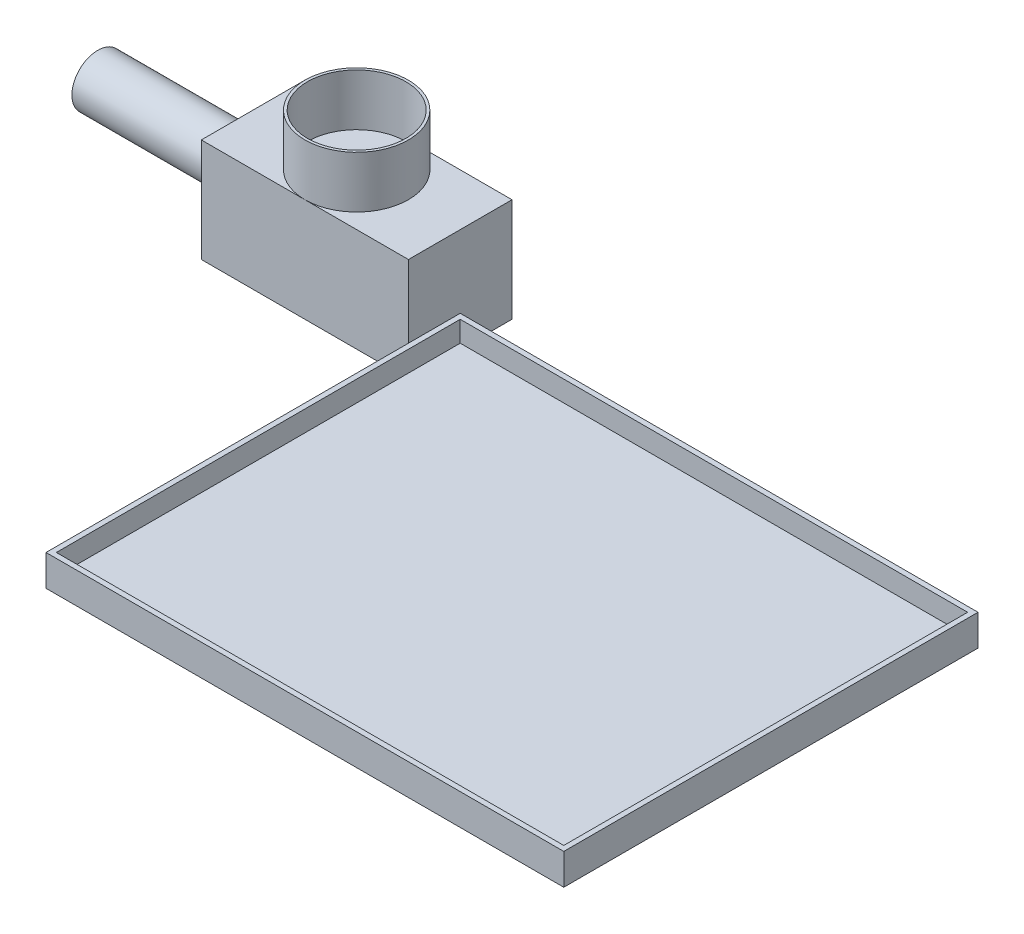
ISO-10303-21;
HEADER;
FILE_DESCRIPTION(('STEP AP214'),'2;1');
FILE_NAME('part.step','',(''),(''),'','','');
FILE_SCHEMA(('AUTOMOTIVE_DESIGN { 1 0 10303 214 1 1 1 1 }'));
ENDSEC;
DATA;
#1=APPLICATION_CONTEXT('core data for automotive mechanical design processes');
#2=APPLICATION_PROTOCOL_DEFINITION('international standard','automotive_design',2000,#1);
#3=PRODUCT_CONTEXT('',#1,'mechanical');
#4=PRODUCT('Part','Part','',(#3));
#5=PRODUCT_RELATED_PRODUCT_CATEGORY('part','',(#4));
#6=PRODUCT_DEFINITION_FORMATION('','',#4);
#7=PRODUCT_DEFINITION_CONTEXT('part definition',#1,'design');
#8=PRODUCT_DEFINITION('design','',#6,#7);
#9=PRODUCT_DEFINITION_SHAPE('','',#8);
#10=(LENGTH_UNIT() NAMED_UNIT(*) SI_UNIT(.MILLI.,.METRE.));
#11=(NAMED_UNIT(*) PLANE_ANGLE_UNIT() SI_UNIT($,.RADIAN.));
#12=(NAMED_UNIT(*) SI_UNIT($,.STERADIAN.) SOLID_ANGLE_UNIT());
#13=UNCERTAINTY_MEASURE_WITH_UNIT(LENGTH_MEASURE(1.E-05),#10,'distance_accuracy_value','');
#14=(GEOMETRIC_REPRESENTATION_CONTEXT(3) GLOBAL_UNCERTAINTY_ASSIGNED_CONTEXT((#13)) GLOBAL_UNIT_ASSIGNED_CONTEXT((#10,
#11,#12)) REPRESENTATION_CONTEXT('',''));
#15=CARTESIAN_POINT('',(0.,0.,0.));
#16=DIRECTION('',(0.,0.,1.));
#17=DIRECTION('',(1.,0.,0.));
#18=AXIS2_PLACEMENT_3D('',#15,#16,#17);
#19=CARTESIAN_POINT('',(845.,-20.,395.));
#20=DIRECTION('',(-1.,0.,0.));
#21=DIRECTION('',(0.,0.,1.));
#22=AXIS2_PLACEMENT_3D('',#19,#20,#21);
#23=PLANE('',#22);
#24=DIRECTION('',(0.,-1.,0.));
#25=VECTOR('',#24,1.);
#26=CARTESIAN_POINT('',(845.,-20.,5.));
#27=LINE('',#26,#25);
#28=CARTESIAN_POINT('',(845.,-20.,5.));
#29=VERTEX_POINT('',#28);
#30=CARTESIAN_POINT('',(845.,-40.,5.));
#31=VERTEX_POINT('',#30);
#32=EDGE_CURVE('E161',#29,#31,#27,.T.);
#33=ORIENTED_EDGE('',*,*,#32,.T.);
#34=DIRECTION('',(0.,0.,1.));
#35=VECTOR('',#34,1.);
#36=CARTESIAN_POINT('',(845.,-40.,395.));
#37=LINE('',#36,#35);
#38=CARTESIAN_POINT('',(845.,-40.,395.));
#39=VERTEX_POINT('',#38);
#40=EDGE_CURVE('E143',#31,#39,#37,.T.);
#41=ORIENTED_EDGE('',*,*,#40,.T.);
#42=DIRECTION('',(0.,-1.,0.));
#43=VECTOR('',#42,1.);
#44=CARTESIAN_POINT('',(845.,-20.,395.));
#45=LINE('',#44,#43);
#46=CARTESIAN_POINT('',(845.,-20.,395.));
#47=VERTEX_POINT('',#46);
#48=EDGE_CURVE('E165',#47,#39,#45,.T.);
#49=ORIENTED_EDGE('',*,*,#48,.F.);
#50=DIRECTION('',(0.,0.,-1.));
#51=VECTOR('',#50,1.);
#52=CARTESIAN_POINT('',(845.,-20.,395.));
#53=LINE('',#52,#51);
#54=EDGE_CURVE('E430',#47,#29,#53,.T.);
#55=ORIENTED_EDGE('',*,*,#54,.T.);
#56=EDGE_LOOP('',(#33,#41,#49,#55));
#57=FACE_BOUND('',#56,.T.);
#58=ADVANCED_FACE('F39',(#57),#23,.T.);
#59=CARTESIAN_POINT('',(355.,-20.,5.));
#60=DIRECTION('',(0.,0.,1.));
#61=DIRECTION('',(1.,0.,0.));
#62=AXIS2_PLACEMENT_3D('',#59,#60,#61);
#63=PLANE('',#62);
#64=DIRECTION('',(0.,-1.,0.));
#65=VECTOR('',#64,1.);
#66=CARTESIAN_POINT('',(355.,-20.,5.));
#67=LINE('',#66,#65);
#68=CARTESIAN_POINT('',(355.,-20.,5.));
#69=VERTEX_POINT('',#68);
#70=CARTESIAN_POINT('',(355.,-40.,5.));
#71=VERTEX_POINT('',#70);
#72=EDGE_CURVE('E154',#69,#71,#67,.T.);
#73=ORIENTED_EDGE('',*,*,#72,.T.);
#74=DIRECTION('',(1.,0.,0.));
#75=VECTOR('',#74,1.);
#76=CARTESIAN_POINT('',(355.,-40.,5.));
#77=LINE('',#76,#75);
#78=EDGE_CURVE('E140',#71,#31,#77,.T.);
#79=ORIENTED_EDGE('',*,*,#78,.T.);
#80=ORIENTED_EDGE('',*,*,#32,.F.);
#81=DIRECTION('',(-1.,0.,0.));
#82=VECTOR('',#81,1.);
#83=CARTESIAN_POINT('',(355.,-20.,5.));
#84=LINE('',#83,#82);
#85=EDGE_CURVE('E160',#29,#69,#84,.T.);
#86=ORIENTED_EDGE('',*,*,#85,.T.);
#87=EDGE_LOOP('',(#73,#79,#80,#86));
#88=FACE_BOUND('',#87,.T.);
#89=ADVANCED_FACE('F158',(#88),#63,.T.);
#90=CARTESIAN_POINT('',(355.,-20.,395.));
#91=DIRECTION('',(1.,0.,0.));
#92=DIRECTION('',(0.,0.,-1.));
#93=AXIS2_PLACEMENT_3D('',#90,#91,#92);
#94=PLANE('',#93);
#95=DIRECTION('',(0.,-1.,0.));
#96=VECTOR('',#95,1.);
#97=CARTESIAN_POINT('',(355.,-20.,395.));
#98=LINE('',#97,#96);
#99=CARTESIAN_POINT('',(355.,-20.,395.));
#100=VERTEX_POINT('',#99);
#101=CARTESIAN_POINT('',(355.,-40.,395.));
#102=VERTEX_POINT('',#101);
#103=EDGE_CURVE('E156',#100,#102,#98,.T.);
#104=ORIENTED_EDGE('',*,*,#103,.T.);
#105=DIRECTION('',(0.,0.,-1.));
#106=VECTOR('',#105,1.);
#107=CARTESIAN_POINT('',(355.,-40.,395.));
#108=LINE('',#107,#106);
#109=EDGE_CURVE('E57',#102,#71,#108,.T.);
#110=ORIENTED_EDGE('',*,*,#109,.T.);
#111=ORIENTED_EDGE('',*,*,#72,.F.);
#112=DIRECTION('',(0.,0.,1.));
#113=VECTOR('',#112,1.);
#114=CARTESIAN_POINT('',(355.,-20.,395.));
#115=LINE('',#114,#113);
#116=EDGE_CURVE('E425',#69,#100,#115,.T.);
#117=ORIENTED_EDGE('',*,*,#116,.T.);
#118=EDGE_LOOP('',(#104,#110,#111,#117));
#119=FACE_BOUND('',#118,.T.);
#120=ADVANCED_FACE('F152',(#119),#94,.T.);
#121=CARTESIAN_POINT('',(355.,-20.,395.));
#122=DIRECTION('',(0.,0.,-1.));
#123=DIRECTION('',(-1.,0.,0.));
#124=AXIS2_PLACEMENT_3D('',#121,#122,#123);
#125=PLANE('',#124);
#126=ORIENTED_EDGE('',*,*,#48,.T.);
#127=DIRECTION('',(-1.,0.,0.));
#128=VECTOR('',#127,1.);
#129=CARTESIAN_POINT('',(355.,-40.,395.));
#130=LINE('',#129,#128);
#131=EDGE_CURVE('E421',#39,#102,#130,.T.);
#132=ORIENTED_EDGE('',*,*,#131,.T.);
#133=ORIENTED_EDGE('',*,*,#103,.F.);
#134=DIRECTION('',(1.,0.,0.));
#135=VECTOR('',#134,1.);
#136=CARTESIAN_POINT('',(355.,-20.,395.));
#137=LINE('',#136,#135);
#138=EDGE_CURVE('E423',#100,#47,#137,.T.);
#139=ORIENTED_EDGE('',*,*,#138,.T.);
#140=EDGE_LOOP('',(#126,#132,#133,#139));
#141=FACE_BOUND('',#140,.T.);
#142=ADVANCED_FACE('F304',(#141),#125,.T.);
#143=CARTESIAN_POINT('',(350.,0.,0.));
#144=DIRECTION('',(-1.,0.,0.));
#145=DIRECTION('',(0.,0.,1.));
#146=AXIS2_PLACEMENT_3D('',#143,#144,#145);
#147=PLANE('',#146);
#148=DIRECTION('',(0.,0.,1.));
#149=VECTOR('',#148,1.);
#150=CARTESIAN_POINT('',(350.,-20.,0.));
#151=LINE('',#150,#149);
#152=CARTESIAN_POINT('',(350.,-20.,0.));
#153=VERTEX_POINT('',#152);
#154=CARTESIAN_POINT('',(350.,-20.,50.));
#155=VERTEX_POINT('',#154);
#156=EDGE_CURVE('E169',#153,#155,#151,.T.);
#157=ORIENTED_EDGE('',*,*,#156,.F.);
#158=DIRECTION('',(0.,-1.,0.));
#159=VECTOR('',#158,1.);
#160=CARTESIAN_POINT('',(350.,-20.,0.));
#161=LINE('',#160,#159);
#162=CARTESIAN_POINT('',(350.,-50.,0.));
#163=VERTEX_POINT('',#162);
#164=EDGE_CURVE('E179',#153,#163,#161,.T.);
#165=ORIENTED_EDGE('',*,*,#164,.T.);
#166=DIRECTION('',(0.,0.,-1.));
#167=VECTOR('',#166,1.);
#168=CARTESIAN_POINT('',(350.,-50.,50.));
#169=LINE('',#168,#167);
#170=CARTESIAN_POINT('',(350.,-50.,-50.));
#171=VERTEX_POINT('',#170);
#172=EDGE_CURVE('E216',#163,#171,#169,.T.);
#173=ORIENTED_EDGE('',*,*,#172,.T.);
#174=DIRECTION('',(0.,1.,0.));
#175=VECTOR('',#174,1.);
#176=CARTESIAN_POINT('',(350.,-50.,-50.));
#177=LINE('',#176,#175);
#178=CARTESIAN_POINT('',(350.,50.,-50.));
#179=VERTEX_POINT('',#178);
#180=EDGE_CURVE('E206',#171,#179,#177,.T.);
#181=ORIENTED_EDGE('',*,*,#180,.T.);
#182=DIRECTION('',(0.,0.,1.));
#183=VECTOR('',#182,1.);
#184=CARTESIAN_POINT('',(350.,50.,50.));
#185=LINE('',#184,#183);
#186=CARTESIAN_POINT('',(350.,50.,50.));
#187=VERTEX_POINT('',#186);
#188=EDGE_CURVE('E209',#179,#187,#185,.T.);
#189=ORIENTED_EDGE('',*,*,#188,.T.);
#190=DIRECTION('',(0.,-1.,0.));
#191=VECTOR('',#190,1.);
#192=CARTESIAN_POINT('',(350.,-50.,50.));
#193=LINE('',#192,#191);
#194=EDGE_CURVE('E213',#187,#155,#193,.T.);
#195=ORIENTED_EDGE('',*,*,#194,.T.);
#196=EDGE_LOOP('',(#157,#165,#173,#181,#189,#195));
#197=FACE_BOUND('',#196,.T.);
#198=ADVANCED_FACE('F301',(#197),#147,.F.);
#199=CARTESIAN_POINT('',(350.,50.,50.));
#200=DIRECTION('',(0.,-1.,0.));
#201=DIRECTION('',(0.,0.,-1.));
#202=AXIS2_PLACEMENT_3D('',#199,#200,#201);
#203=PLANE('',#202);
#204=CARTESIAN_POINT('',(250.,50.,0.));
#205=DIRECTION('',(0.,1.,0.));
#206=DIRECTION('',(0.,0.,1.));
#207=AXIS2_PLACEMENT_3D('',#204,#205,#206);
#208=CIRCLE('',#207,50.);
#209=CARTESIAN_POINT('',(250.,50.,50.));
#210=VERTEX_POINT('',#209);
#211=CARTESIAN_POINT('',(250.,50.,-50.));
#212=VERTEX_POINT('',#211);
#213=EDGE_CURVE('E50',#210,#212,#208,.T.);
#214=ORIENTED_EDGE('',*,*,#213,.F.);
#215=DIRECTION('',(-1.,0.,0.));
#216=VECTOR('',#215,1.);
#217=CARTESIAN_POINT('',(350.,50.,50.));
#218=LINE('',#217,#216);
#219=EDGE_CURVE('E233',#187,#210,#218,.T.);
#220=ORIENTED_EDGE('',*,*,#219,.F.);
#221=ORIENTED_EDGE('',*,*,#188,.F.);
#222=DIRECTION('',(-1.,0.,0.));
#223=VECTOR('',#222,1.);
#224=CARTESIAN_POINT('',(350.,50.,-50.));
#225=LINE('',#224,#223);
#226=EDGE_CURVE('E236',#179,#212,#225,.T.);
#227=ORIENTED_EDGE('',*,*,#226,.T.);
#228=EDGE_LOOP('',(#214,#220,#221,#227));
#229=FACE_BOUND('',#228,.T.);
#230=ADVANCED_FACE('F256',(#229),#203,.F.);
#231=CARTESIAN_POINT('',(150.,0.,0.));
#232=DIRECTION('',(-1.,0.,0.));
#233=DIRECTION('',(0.,0.,1.));
#234=AXIS2_PLACEMENT_3D('',#231,#232,#233);
#235=CYLINDRICAL_SURFACE('',#234,25.);
#236=CARTESIAN_POINT('',(150.,0.,0.));
#237=DIRECTION('',(1.,0.,0.));
#238=DIRECTION('',(0.,0.,-1.));
#239=AXIS2_PLACEMENT_3D('',#236,#237,#238);
#240=CIRCLE('',#239,25.);
#241=CARTESIAN_POINT('',(150.,0.,-25.));
#242=VERTEX_POINT('',#241);
#243=EDGE_CURVE('E48',#242,#242,#240,.T.);
#244=ORIENTED_EDGE('',*,*,#243,.F.);
#245=EDGE_LOOP('',(#244));
#246=FACE_BOUND('',#245,.T.);
#247=CARTESIAN_POINT('',(0.,0.,0.));
#248=DIRECTION('',(1.,0.,0.));
#249=DIRECTION('',(0.,0.,-1.));
#250=AXIS2_PLACEMENT_3D('',#247,#248,#249);
#251=CIRCLE('',#250,25.);
#252=CARTESIAN_POINT('',(0.,0.,-25.));
#253=VERTEX_POINT('',#252);
#254=EDGE_CURVE('E43',#253,#253,#251,.T.);
#255=ORIENTED_EDGE('',*,*,#254,.T.);
#256=EDGE_LOOP('',(#255));
#257=FACE_BOUND('',#256,.T.);
#258=ADVANCED_FACE('F41',(#246,#257),#235,.T.);
#259=CARTESIAN_POINT('',(0.,0.,0.));
#260=DIRECTION('',(1.,0.,0.));
#261=DIRECTION('',(0.,0.,-1.));
#262=AXIS2_PLACEMENT_3D('',#259,#260,#261);
#263=PLANE('',#262);
#264=ORIENTED_EDGE('',*,*,#254,.F.);
#265=EDGE_LOOP('',(#264));
#266=FACE_BOUND('',#265,.T.);
#267=ADVANCED_FACE('F245',(#266),#263,.F.);
#268=CARTESIAN_POINT('',(350.,-50.,-50.));
#269=DIRECTION('',(0.,0.,1.));
#270=DIRECTION('',(1.,0.,0.));
#271=AXIS2_PLACEMENT_3D('',#268,#269,#270);
#272=PLANE('',#271);
#273=DIRECTION('',(0.,1.,0.));
#274=VECTOR('',#273,1.);
#275=CARTESIAN_POINT('',(150.,-50.,-50.));
#276=LINE('',#275,#274);
#277=CARTESIAN_POINT('',(150.,-50.,-50.));
#278=VERTEX_POINT('',#277);
#279=CARTESIAN_POINT('',(150.,50.,-50.));
#280=VERTEX_POINT('',#279);
#281=EDGE_CURVE('E203',#278,#280,#276,.T.);
#282=ORIENTED_EDGE('',*,*,#281,.T.);
#283=EDGE_CURVE('E235',#212,#280,#225,.T.);
#284=ORIENTED_EDGE('',*,*,#283,.F.);
#285=ORIENTED_EDGE('',*,*,#226,.F.);
#286=ORIENTED_EDGE('',*,*,#180,.F.);
#287=DIRECTION('',(-1.,0.,0.));
#288=VECTOR('',#287,1.);
#289=CARTESIAN_POINT('',(350.,-50.,-50.));
#290=LINE('',#289,#288);
#291=EDGE_CURVE('E218',#171,#278,#290,.T.);
#292=ORIENTED_EDGE('',*,*,#291,.T.);
#293=EDGE_LOOP('',(#282,#284,#285,#286,#292));
#294=FACE_BOUND('',#293,.T.);
#295=ADVANCED_FACE('F247',(#294),#272,.F.);
#296=EDGE_CURVE('E11',#212,#210,#208,.T.);
#297=ORIENTED_EDGE('',*,*,#296,.F.);
#298=ORIENTED_EDGE('',*,*,#283,.T.);
#299=DIRECTION('',(0.,0.,1.));
#300=VECTOR('',#299,1.);
#301=CARTESIAN_POINT('',(150.,50.,50.));
#302=LINE('',#301,#300);
#303=CARTESIAN_POINT('',(150.,50.,50.));
#304=VERTEX_POINT('',#303);
#305=EDGE_CURVE('E221',#280,#304,#302,.T.);
#306=ORIENTED_EDGE('',*,*,#305,.T.);
#307=EDGE_CURVE('E232',#210,#304,#218,.T.);
#308=ORIENTED_EDGE('',*,*,#307,.F.);
#309=EDGE_LOOP('',(#297,#298,#306,#308));
#310=FACE_BOUND('',#309,.T.);
#311=ADVANCED_FACE('F253',(#310),#203,.F.);
#312=CARTESIAN_POINT('',(350.,-50.,50.));
#313=DIRECTION('',(0.,0.,-1.));
#314=DIRECTION('',(-1.,0.,0.));
#315=AXIS2_PLACEMENT_3D('',#312,#313,#314);
#316=PLANE('',#315);
#317=DIRECTION('',(0.,-1.,0.));
#318=VECTOR('',#317,1.);
#319=CARTESIAN_POINT('',(150.,-50.,50.));
#320=LINE('',#319,#318);
#321=CARTESIAN_POINT('',(150.,-50.,50.));
#322=VERTEX_POINT('',#321);
#323=EDGE_CURVE('E224',#304,#322,#320,.T.);
#324=ORIENTED_EDGE('',*,*,#323,.T.);
#325=DIRECTION('',(-1.,0.,0.));
#326=VECTOR('',#325,1.);
#327=CARTESIAN_POINT('',(350.,-50.,50.));
#328=LINE('',#327,#326);
#329=CARTESIAN_POINT('',(350.,-50.,50.));
#330=VERTEX_POINT('',#329);
#331=EDGE_CURVE('E229',#330,#322,#328,.T.);
#332=ORIENTED_EDGE('',*,*,#331,.F.);
#333=EDGE_CURVE('E212',#155,#330,#193,.T.);
#334=ORIENTED_EDGE('',*,*,#333,.F.);
#335=ORIENTED_EDGE('',*,*,#194,.F.);
#336=ORIENTED_EDGE('',*,*,#219,.T.);
#337=ORIENTED_EDGE('',*,*,#307,.T.);
#338=EDGE_LOOP('',(#324,#332,#334,#335,#336,#337));
#339=FACE_BOUND('',#338,.T.);
#340=ADVANCED_FACE('F311',(#339),#316,.F.);
#341=CARTESIAN_POINT('',(350.,-50.,50.));
#342=DIRECTION('',(0.,1.,0.));
#343=DIRECTION('',(0.,0.,1.));
#344=AXIS2_PLACEMENT_3D('',#341,#342,#343);
#345=PLANE('',#344);
#346=DIRECTION('',(0.,0.,-1.));
#347=VECTOR('',#346,1.);
#348=CARTESIAN_POINT('',(150.,-50.,50.));
#349=LINE('',#348,#347);
#350=EDGE_CURVE('E210',#322,#278,#349,.T.);
#351=ORIENTED_EDGE('',*,*,#350,.T.);
#352=ORIENTED_EDGE('',*,*,#291,.F.);
#353=ORIENTED_EDGE('',*,*,#172,.F.);
#354=DIRECTION('',(-1.,0.,0.));
#355=VECTOR('',#354,1.);
#356=CARTESIAN_POINT('',(350.,-50.,0.));
#357=LINE('',#356,#355);
#358=CARTESIAN_POINT('',(850.,-50.,0.));
#359=VERTEX_POINT('',#358);
#360=EDGE_CURVE('E65',#359,#163,#357,.T.);
#361=ORIENTED_EDGE('',*,*,#360,.F.);
#362=DIRECTION('',(0.,0.,-1.));
#363=VECTOR('',#362,1.);
#364=CARTESIAN_POINT('',(850.,-50.,0.));
#365=LINE('',#364,#363);
#366=CARTESIAN_POINT('',(850.,-50.,400.));
#367=VERTEX_POINT('',#366);
#368=EDGE_CURVE('E183',#367,#359,#365,.T.);
#369=ORIENTED_EDGE('',*,*,#368,.F.);
#370=DIRECTION('',(1.,0.,0.));
#371=VECTOR('',#370,1.);
#372=CARTESIAN_POINT('',(350.,-50.,400.));
#373=LINE('',#372,#371);
#374=CARTESIAN_POINT('',(350.,-50.,400.));
#375=VERTEX_POINT('',#374);
#376=EDGE_CURVE('E181',#375,#367,#373,.T.);
#377=ORIENTED_EDGE('',*,*,#376,.F.);
#378=DIRECTION('',(0.,0.,1.));
#379=VECTOR('',#378,1.);
#380=CARTESIAN_POINT('',(350.,-50.,0.));
#381=LINE('',#380,#379);
#382=EDGE_CURVE('E163',#330,#375,#381,.T.);
#383=ORIENTED_EDGE('',*,*,#382,.F.);
#384=ORIENTED_EDGE('',*,*,#331,.T.);
#385=EDGE_LOOP('',(#351,#352,#353,#361,#369,#377,#383,#384));
#386=FACE_BOUND('',#385,.T.);
#387=ADVANCED_FACE('F308',(#386),#345,.F.);
#388=CARTESIAN_POINT('',(150.,0.,0.));
#389=DIRECTION('',(-1.,0.,0.));
#390=DIRECTION('',(0.,0.,1.));
#391=AXIS2_PLACEMENT_3D('',#388,#389,#390);
#392=PLANE('',#391);
#393=ORIENTED_EDGE('',*,*,#243,.T.);
#394=EDGE_LOOP('',(#393));
#395=FACE_BOUND('',#394,.T.);
#396=ORIENTED_EDGE('',*,*,#281,.F.);
#397=ORIENTED_EDGE('',*,*,#350,.F.);
#398=ORIENTED_EDGE('',*,*,#323,.F.);
#399=ORIENTED_EDGE('',*,*,#305,.F.);
#400=EDGE_LOOP('',(#396,#397,#398,#399));
#401=FACE_BOUND('',#400,.T.);
#402=ADVANCED_FACE('F296',(#395,#401),#392,.T.);
#403=CARTESIAN_POINT('',(250.,100.,0.));
#404=DIRECTION('',(0.,1.,0.));
#405=DIRECTION('',(0.,0.,1.));
#406=AXIS2_PLACEMENT_3D('',#403,#404,#405);
#407=PLANE('',#406);
#408=CARTESIAN_POINT('',(250.,100.,0.));
#409=DIRECTION('',(0.,1.,0.));
#410=DIRECTION('',(0.,0.,1.));
#411=AXIS2_PLACEMENT_3D('',#408,#409,#410);
#412=CIRCLE('',#411,50.);
#413=CARTESIAN_POINT('',(250.,100.,50.));
#414=VERTEX_POINT('',#413);
#415=EDGE_CURVE('E201',#414,#414,#412,.T.);
#416=ORIENTED_EDGE('',*,*,#415,.T.);
#417=EDGE_LOOP('',(#416));
#418=FACE_BOUND('',#417,.T.);
#419=CARTESIAN_POINT('',(250.,100.,0.));
#420=DIRECTION('',(0.,1.,0.));
#421=DIRECTION('',(0.,0.,1.));
#422=AXIS2_PLACEMENT_3D('',#419,#420,#421);
#423=CIRCLE('',#422,47.5);
#424=CARTESIAN_POINT('',(250.,100.,47.5));
#425=VERTEX_POINT('',#424);
#426=EDGE_CURVE('E196',#425,#425,#423,.T.);
#427=ORIENTED_EDGE('',*,*,#426,.F.);
#428=EDGE_LOOP('',(#427));
#429=FACE_BOUND('',#428,.T.);
#430=ADVANCED_FACE('F293',(#418,#429),#407,.T.);
#431=CARTESIAN_POINT('',(250.,100.,0.));
#432=DIRECTION('',(0.,-1.,0.));
#433=DIRECTION('',(0.,0.,-1.));
#434=AXIS2_PLACEMENT_3D('',#431,#432,#433);
#435=CYLINDRICAL_SURFACE('',#434,50.);
#436=ORIENTED_EDGE('',*,*,#415,.F.);
#437=EDGE_LOOP('',(#436));
#438=FACE_BOUND('',#437,.T.);
#439=ORIENTED_EDGE('',*,*,#213,.T.);
#440=ORIENTED_EDGE('',*,*,#296,.T.);
#441=EDGE_LOOP('',(#439,#440));
#442=FACE_BOUND('',#441,.T.);
#443=ADVANCED_FACE('F291',(#438,#442),#435,.T.);
#444=CARTESIAN_POINT('',(250.,100.,0.));
#445=DIRECTION('',(0.,-1.,0.));
#446=DIRECTION('',(0.,0.,-1.));
#447=AXIS2_PLACEMENT_3D('',#444,#445,#446);
#448=CYLINDRICAL_SURFACE('',#447,47.5);
#449=ORIENTED_EDGE('',*,*,#426,.T.);
#450=EDGE_LOOP('',(#449));
#451=FACE_BOUND('',#450,.T.);
#452=CARTESIAN_POINT('',(250.,50.,0.));
#453=DIRECTION('',(0.,1.,0.));
#454=DIRECTION('',(0.,0.,1.));
#455=AXIS2_PLACEMENT_3D('',#452,#453,#454);
#456=CIRCLE('',#455,47.5);
#457=CARTESIAN_POINT('',(250.,50.,47.5));
#458=VERTEX_POINT('',#457);
#459=EDGE_CURVE('E195',#458,#458,#456,.T.);
#460=ORIENTED_EDGE('',*,*,#459,.F.);
#461=EDGE_LOOP('',(#460));
#462=FACE_BOUND('',#461,.T.);
#463=ADVANCED_FACE('F288',(#451,#462),#448,.F.);
#464=ORIENTED_EDGE('',*,*,#459,.T.);
#465=EDGE_LOOP('',(#464));
#466=FACE_BOUND('',#465,.T.);
#467=ADVANCED_FACE('F286',(#466),#203,.F.);
#468=CARTESIAN_POINT('',(350.,-20.,0.));
#469=DIRECTION('',(1.,0.,0.));
#470=DIRECTION('',(0.,0.,-1.));
#471=AXIS2_PLACEMENT_3D('',#468,#469,#470);
#472=PLANE('',#471);
#473=CARTESIAN_POINT('',(350.,-20.,400.));
#474=VERTEX_POINT('',#473);
#475=EDGE_CURVE('E173',#155,#474,#151,.T.);
#476=ORIENTED_EDGE('',*,*,#475,.F.);
#477=ORIENTED_EDGE('',*,*,#333,.T.);
#478=ORIENTED_EDGE('',*,*,#382,.T.);
#479=DIRECTION('',(0.,-1.,0.));
#480=VECTOR('',#479,1.);
#481=CARTESIAN_POINT('',(350.,-20.,400.));
#482=LINE('',#481,#480);
#483=EDGE_CURVE('E192',#474,#375,#482,.T.);
#484=ORIENTED_EDGE('',*,*,#483,.F.);
#485=EDGE_LOOP('',(#476,#477,#478,#484));
#486=FACE_BOUND('',#485,.T.);
#487=ADVANCED_FACE('F272',(#486),#472,.F.);
#488=CARTESIAN_POINT('',(0.,-20.,0.));
#489=DIRECTION('',(0.,1.,0.));
#490=DIRECTION('',(0.,0.,1.));
#491=AXIS2_PLACEMENT_3D('',#488,#489,#490);
#492=PLANE('',#491);
#493=ORIENTED_EDGE('',*,*,#156,.T.);
#494=ORIENTED_EDGE('',*,*,#475,.T.);
#495=DIRECTION('',(1.,0.,0.));
#496=VECTOR('',#495,1.);
#497=CARTESIAN_POINT('',(350.,-20.,400.));
#498=LINE('',#497,#496);
#499=CARTESIAN_POINT('',(850.,-20.,400.));
#500=VERTEX_POINT('',#499);
#501=EDGE_CURVE('E172',#474,#500,#498,.T.);
#502=ORIENTED_EDGE('',*,*,#501,.T.);
#503=DIRECTION('',(0.,0.,-1.));
#504=VECTOR('',#503,1.);
#505=CARTESIAN_POINT('',(850.,-20.,0.));
#506=LINE('',#505,#504);
#507=CARTESIAN_POINT('',(850.,-20.,0.));
#508=VERTEX_POINT('',#507);
#509=EDGE_CURVE('E175',#500,#508,#506,.T.);
#510=ORIENTED_EDGE('',*,*,#509,.T.);
#511=DIRECTION('',(-1.,0.,0.));
#512=VECTOR('',#511,1.);
#513=CARTESIAN_POINT('',(350.,-20.,0.));
#514=LINE('',#513,#512);
#515=EDGE_CURVE('E177',#508,#153,#514,.T.);
#516=ORIENTED_EDGE('',*,*,#515,.T.);
#517=EDGE_LOOP('',(#493,#494,#502,#510,#516));
#518=FACE_BOUND('',#517,.T.);
#519=ORIENTED_EDGE('',*,*,#85,.F.);
#520=ORIENTED_EDGE('',*,*,#54,.F.);
#521=ORIENTED_EDGE('',*,*,#138,.F.);
#522=ORIENTED_EDGE('',*,*,#116,.F.);
#523=EDGE_LOOP('',(#519,#520,#521,#522));
#524=FACE_BOUND('',#523,.T.);
#525=ADVANCED_FACE('F268',(#518,#524),#492,.T.);
#526=CARTESIAN_POINT('',(350.,-20.,400.));
#527=DIRECTION('',(0.,0.,-1.));
#528=DIRECTION('',(-1.,0.,0.));
#529=AXIS2_PLACEMENT_3D('',#526,#527,#528);
#530=PLANE('',#529);
#531=ORIENTED_EDGE('',*,*,#376,.T.);
#532=DIRECTION('',(0.,-1.,0.));
#533=VECTOR('',#532,1.);
#534=CARTESIAN_POINT('',(850.,-20.,400.));
#535=LINE('',#534,#533);
#536=EDGE_CURVE('E189',#500,#367,#535,.T.);
#537=ORIENTED_EDGE('',*,*,#536,.F.);
#538=ORIENTED_EDGE('',*,*,#501,.F.);
#539=ORIENTED_EDGE('',*,*,#483,.T.);
#540=EDGE_LOOP('',(#531,#537,#538,#539));
#541=FACE_BOUND('',#540,.T.);
#542=ADVANCED_FACE('F271',(#541),#530,.F.);
#543=CARTESIAN_POINT('',(850.,-20.,0.));
#544=DIRECTION('',(-1.,0.,0.));
#545=DIRECTION('',(0.,0.,1.));
#546=AXIS2_PLACEMENT_3D('',#543,#544,#545);
#547=PLANE('',#546);
#548=ORIENTED_EDGE('',*,*,#368,.T.);
#549=DIRECTION('',(0.,-1.,0.));
#550=VECTOR('',#549,1.);
#551=CARTESIAN_POINT('',(850.,-20.,0.));
#552=LINE('',#551,#550);
#553=EDGE_CURVE('E187',#508,#359,#552,.T.);
#554=ORIENTED_EDGE('',*,*,#553,.F.);
#555=ORIENTED_EDGE('',*,*,#509,.F.);
#556=ORIENTED_EDGE('',*,*,#536,.T.);
#557=EDGE_LOOP('',(#548,#554,#555,#556));
#558=FACE_BOUND('',#557,.T.);
#559=ADVANCED_FACE('F277',(#558),#547,.F.);
#560=CARTESIAN_POINT('',(350.,-20.,0.));
#561=DIRECTION('',(0.,0.,1.));
#562=DIRECTION('',(1.,0.,0.));
#563=AXIS2_PLACEMENT_3D('',#560,#561,#562);
#564=PLANE('',#563);
#565=ORIENTED_EDGE('',*,*,#360,.T.);
#566=ORIENTED_EDGE('',*,*,#164,.F.);
#567=ORIENTED_EDGE('',*,*,#515,.F.);
#568=ORIENTED_EDGE('',*,*,#553,.T.);
#569=EDGE_LOOP('',(#565,#566,#567,#568));
#570=FACE_BOUND('',#569,.T.);
#571=ADVANCED_FACE('F274',(#570),#564,.F.);
#572=CARTESIAN_POINT('',(0.,-40.,0.));
#573=DIRECTION('',(0.,-1.,0.));
#574=DIRECTION('',(0.,0.,-1.));
#575=AXIS2_PLACEMENT_3D('',#572,#573,#574);
#576=PLANE('',#575);
#577=ORIENTED_EDGE('',*,*,#109,.F.);
#578=ORIENTED_EDGE('',*,*,#131,.F.);
#579=ORIENTED_EDGE('',*,*,#40,.F.);
#580=ORIENTED_EDGE('',*,*,#78,.F.);
#581=EDGE_LOOP('',(#577,#578,#579,#580));
#582=FACE_BOUND('',#581,.T.);
#583=ADVANCED_FACE('F141',(#582),#576,.F.);
#584=CLOSED_SHELL('',(#58,#89,#120,#142,#198,#230,#258,#267,#295,#311,#340,#387,#402,#430,#443,
#463,#467,#487,#525,#542,#559,#571,#583));
#585=MANIFOLD_SOLID_BREP('B2',#584);
#586=ADVANCED_BREP_SHAPE_REPRESENTATION('',(#18,#585),#14);
#587=SHAPE_DEFINITION_REPRESENTATION(#9,#586);
ENDSEC;
END-ISO-10303-21;
